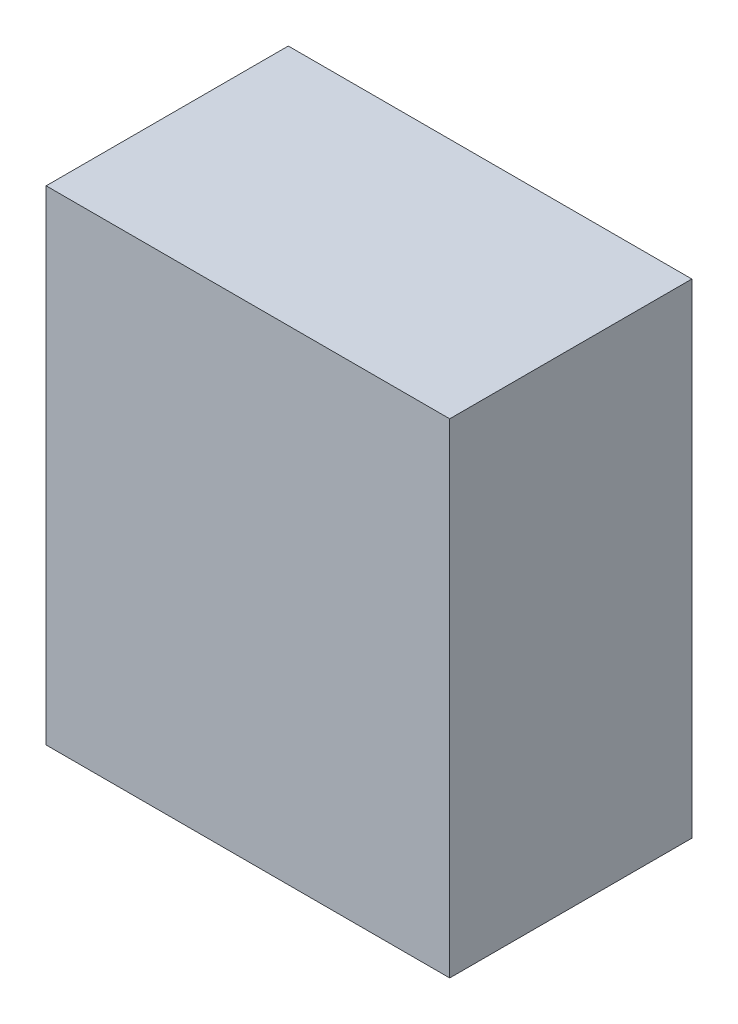
ISO-10303-21;
HEADER;
FILE_DESCRIPTION(('STEP AP214'),'2;1');
FILE_NAME('part.step','',(''),(''),'','','');
FILE_SCHEMA(('AUTOMOTIVE_DESIGN { 1 0 10303 214 1 1 1 1 }'));
ENDSEC;
DATA;
#1=APPLICATION_CONTEXT('core data for automotive mechanical design processes');
#2=APPLICATION_PROTOCOL_DEFINITION('international standard','automotive_design',2000,#1);
#3=PRODUCT_CONTEXT('',#1,'mechanical');
#4=PRODUCT('Part','Part','',(#3));
#5=PRODUCT_RELATED_PRODUCT_CATEGORY('part','',(#4));
#6=PRODUCT_DEFINITION_FORMATION('','',#4);
#7=PRODUCT_DEFINITION_CONTEXT('part definition',#1,'design');
#8=PRODUCT_DEFINITION('design','',#6,#7);
#9=PRODUCT_DEFINITION_SHAPE('','',#8);
#10=(LENGTH_UNIT() NAMED_UNIT(*) SI_UNIT(.MILLI.,.METRE.));
#11=(NAMED_UNIT(*) PLANE_ANGLE_UNIT() SI_UNIT($,.RADIAN.));
#12=(NAMED_UNIT(*) SI_UNIT($,.STERADIAN.) SOLID_ANGLE_UNIT());
#13=UNCERTAINTY_MEASURE_WITH_UNIT(LENGTH_MEASURE(1.E-05),#10,'distance_accuracy_value','');
#14=(GEOMETRIC_REPRESENTATION_CONTEXT(3) GLOBAL_UNCERTAINTY_ASSIGNED_CONTEXT((#13)) GLOBAL_UNIT_ASSIGNED_CONTEXT((#10,
#11,#12)) REPRESENTATION_CONTEXT('',''));
#15=CARTESIAN_POINT('',(0.,0.,0.));
#16=DIRECTION('',(0.,0.,1.));
#17=DIRECTION('',(1.,0.,0.));
#18=AXIS2_PLACEMENT_3D('',#15,#16,#17);
#19=CARTESIAN_POINT('',(125.,-150.,150.));
#20=DIRECTION('',(-1.,0.,0.));
#21=DIRECTION('',(0.,0.,1.));
#22=AXIS2_PLACEMENT_3D('',#19,#20,#21);
#23=PLANE('',#22);
#24=DIRECTION('',(0.,1.,0.));
#25=VECTOR('',#24,1.);
#26=CARTESIAN_POINT('',(125.,-150.,0.));
#27=LINE('',#26,#25);
#28=CARTESIAN_POINT('',(125.,-150.,0.));
#29=VERTEX_POINT('',#28);
#30=CARTESIAN_POINT('',(125.,150.,0.));
#31=VERTEX_POINT('',#30);
#32=EDGE_CURVE('E98',#29,#31,#27,.T.);
#33=ORIENTED_EDGE('',*,*,#32,.T.);
#34=DIRECTION('',(0.,0.,-1.));
#35=VECTOR('',#34,1.);
#36=CARTESIAN_POINT('',(125.,150.,150.));
#37=LINE('',#36,#35);
#38=CARTESIAN_POINT('',(125.,150.,150.));
#39=VERTEX_POINT('',#38);
#40=EDGE_CURVE('E11',#39,#31,#37,.T.);
#41=ORIENTED_EDGE('',*,*,#40,.F.);
#42=DIRECTION('',(0.,1.,0.));
#43=VECTOR('',#42,1.);
#44=CARTESIAN_POINT('',(125.,-150.,150.));
#45=LINE('',#44,#43);
#46=CARTESIAN_POINT('',(125.,-150.,150.));
#47=VERTEX_POINT('',#46);
#48=EDGE_CURVE('E86',#47,#39,#45,.T.);
#49=ORIENTED_EDGE('',*,*,#48,.F.);
#50=DIRECTION('',(0.,0.,-1.));
#51=VECTOR('',#50,1.);
#52=CARTESIAN_POINT('',(125.,-150.,150.));
#53=LINE('',#52,#51);
#54=EDGE_CURVE('E94',#47,#29,#53,.T.);
#55=ORIENTED_EDGE('',*,*,#54,.T.);
#56=EDGE_LOOP('',(#33,#41,#49,#55));
#57=FACE_BOUND('',#56,.T.);
#58=ADVANCED_FACE('F35',(#57),#23,.F.);
#59=CARTESIAN_POINT('',(-125.,150.,150.));
#60=DIRECTION('',(0.,-1.,0.));
#61=DIRECTION('',(0.,0.,-1.));
#62=AXIS2_PLACEMENT_3D('',#59,#60,#61);
#63=PLANE('',#62);
#64=DIRECTION('',(-1.,0.,0.));
#65=VECTOR('',#64,1.);
#66=CARTESIAN_POINT('',(-125.,150.,0.));
#67=LINE('',#66,#65);
#68=CARTESIAN_POINT('',(-125.,150.,0.));
#69=VERTEX_POINT('',#68);
#70=EDGE_CURVE('E90',#31,#69,#67,.T.);
#71=ORIENTED_EDGE('',*,*,#70,.T.);
#72=DIRECTION('',(0.,0.,-1.));
#73=VECTOR('',#72,1.);
#74=CARTESIAN_POINT('',(-125.,150.,150.));
#75=LINE('',#74,#73);
#76=CARTESIAN_POINT('',(-125.,150.,150.));
#77=VERTEX_POINT('',#76);
#78=EDGE_CURVE('E43',#77,#69,#75,.T.);
#79=ORIENTED_EDGE('',*,*,#78,.F.);
#80=DIRECTION('',(-1.,0.,0.));
#81=VECTOR('',#80,1.);
#82=CARTESIAN_POINT('',(-125.,150.,150.));
#83=LINE('',#82,#81);
#84=EDGE_CURVE('E81',#39,#77,#83,.T.);
#85=ORIENTED_EDGE('',*,*,#84,.F.);
#86=ORIENTED_EDGE('',*,*,#40,.T.);
#87=EDGE_LOOP('',(#71,#79,#85,#86));
#88=FACE_BOUND('',#87,.T.);
#89=ADVANCED_FACE('F89',(#88),#63,.F.);
#90=CARTESIAN_POINT('',(-125.,-150.,150.));
#91=DIRECTION('',(1.,0.,0.));
#92=DIRECTION('',(0.,0.,-1.));
#93=AXIS2_PLACEMENT_3D('',#90,#91,#92);
#94=PLANE('',#93);
#95=DIRECTION('',(0.,-1.,0.));
#96=VECTOR('',#95,1.);
#97=CARTESIAN_POINT('',(-125.,-150.,0.));
#98=LINE('',#97,#96);
#99=CARTESIAN_POINT('',(-125.,-150.,0.));
#100=VERTEX_POINT('',#99);
#101=EDGE_CURVE('E68',#69,#100,#98,.T.);
#102=ORIENTED_EDGE('',*,*,#101,.T.);
#103=DIRECTION('',(0.,0.,-1.));
#104=VECTOR('',#103,1.);
#105=CARTESIAN_POINT('',(-125.,-150.,150.));
#106=LINE('',#105,#104);
#107=CARTESIAN_POINT('',(-125.,-150.,150.));
#108=VERTEX_POINT('',#107);
#109=EDGE_CURVE('E91',#108,#100,#106,.T.);
#110=ORIENTED_EDGE('',*,*,#109,.F.);
#111=DIRECTION('',(0.,-1.,0.));
#112=VECTOR('',#111,1.);
#113=CARTESIAN_POINT('',(-125.,-150.,150.));
#114=LINE('',#113,#112);
#115=EDGE_CURVE('E84',#77,#108,#114,.T.);
#116=ORIENTED_EDGE('',*,*,#115,.F.);
#117=ORIENTED_EDGE('',*,*,#78,.T.);
#118=EDGE_LOOP('',(#102,#110,#116,#117));
#119=FACE_BOUND('',#118,.T.);
#120=ADVANCED_FACE('F92',(#119),#94,.F.);
#121=CARTESIAN_POINT('',(-125.,-150.,150.));
#122=DIRECTION('',(0.,1.,0.));
#123=DIRECTION('',(0.,0.,1.));
#124=AXIS2_PLACEMENT_3D('',#121,#122,#123);
#125=PLANE('',#124);
#126=DIRECTION('',(1.,0.,0.));
#127=VECTOR('',#126,1.);
#128=CARTESIAN_POINT('',(-125.,-150.,0.));
#129=LINE('',#128,#127);
#130=EDGE_CURVE('E74',#100,#29,#129,.T.);
#131=ORIENTED_EDGE('',*,*,#130,.T.);
#132=ORIENTED_EDGE('',*,*,#54,.F.);
#133=DIRECTION('',(1.,0.,0.));
#134=VECTOR('',#133,1.);
#135=CARTESIAN_POINT('',(-125.,-150.,150.));
#136=LINE('',#135,#134);
#137=EDGE_CURVE('E51',#108,#47,#136,.T.);
#138=ORIENTED_EDGE('',*,*,#137,.F.);
#139=ORIENTED_EDGE('',*,*,#109,.T.);
#140=EDGE_LOOP('',(#131,#132,#138,#139));
#141=FACE_BOUND('',#140,.T.);
#142=ADVANCED_FACE('F105',(#141),#125,.F.);
#143=CARTESIAN_POINT('',(0.,0.,150.));
#144=DIRECTION('',(0.,0.,-1.));
#145=DIRECTION('',(-1.,0.,0.));
#146=AXIS2_PLACEMENT_3D('',#143,#144,#145);
#147=PLANE('',#146);
#148=ORIENTED_EDGE('',*,*,#48,.T.);
#149=ORIENTED_EDGE('',*,*,#84,.T.);
#150=ORIENTED_EDGE('',*,*,#115,.T.);
#151=ORIENTED_EDGE('',*,*,#137,.T.);
#152=EDGE_LOOP('',(#148,#149,#150,#151));
#153=FACE_BOUND('',#152,.T.);
#154=ADVANCED_FACE('F82',(#153),#147,.F.);
#155=CARTESIAN_POINT('',(0.,0.,0.));
#156=DIRECTION('',(0.,0.,-1.));
#157=DIRECTION('',(-1.,0.,0.));
#158=AXIS2_PLACEMENT_3D('',#155,#156,#157);
#159=PLANE('',#158);
#160=ORIENTED_EDGE('',*,*,#32,.F.);
#161=ORIENTED_EDGE('',*,*,#130,.F.);
#162=ORIENTED_EDGE('',*,*,#101,.F.);
#163=ORIENTED_EDGE('',*,*,#70,.F.);
#164=EDGE_LOOP('',(#160,#161,#162,#163));
#165=FACE_BOUND('',#164,.T.);
#166=ADVANCED_FACE('F108',(#165),#159,.T.);
#167=CLOSED_SHELL('',(#58,#89,#120,#142,#154,#166));
#168=MANIFOLD_SOLID_BREP('B2',#167);
#169=ADVANCED_BREP_SHAPE_REPRESENTATION('',(#18,#168),#14);
#170=SHAPE_DEFINITION_REPRESENTATION(#9,#169);
ENDSEC;
END-ISO-10303-21;
